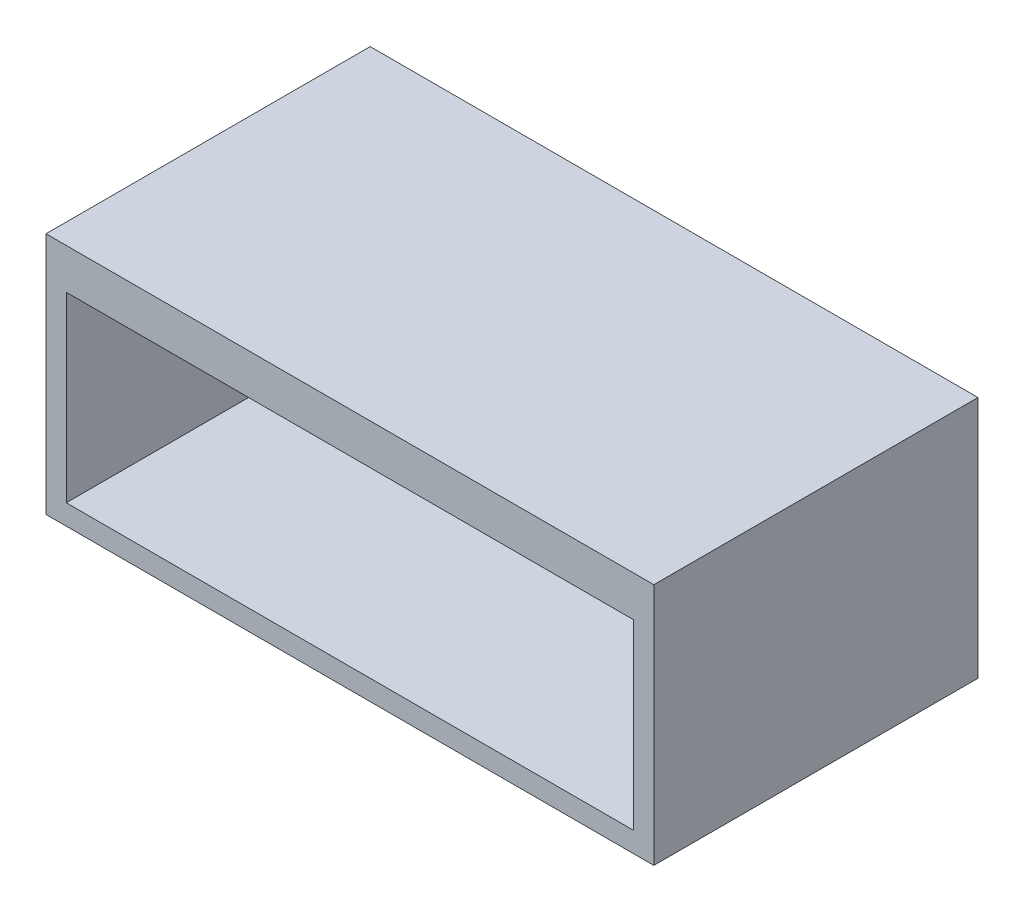
ISO-10303-21;
HEADER;
FILE_DESCRIPTION(('STEP AP214'),'2;1');
FILE_NAME('part.step','',(''),(''),'','','');
FILE_SCHEMA(('AUTOMOTIVE_DESIGN { 1 0 10303 214 1 1 1 1 }'));
ENDSEC;
DATA;
#1=APPLICATION_CONTEXT('core data for automotive mechanical design processes');
#2=APPLICATION_PROTOCOL_DEFINITION('international standard','automotive_design',2000,#1);
#3=PRODUCT_CONTEXT('',#1,'mechanical');
#4=PRODUCT('Part','Part','',(#3));
#5=PRODUCT_RELATED_PRODUCT_CATEGORY('part','',(#4));
#6=PRODUCT_DEFINITION_FORMATION('','',#4);
#7=PRODUCT_DEFINITION_CONTEXT('part definition',#1,'design');
#8=PRODUCT_DEFINITION('design','',#6,#7);
#9=PRODUCT_DEFINITION_SHAPE('','',#8);
#10=(LENGTH_UNIT() NAMED_UNIT(*) SI_UNIT(.MILLI.,.METRE.));
#11=(NAMED_UNIT(*) PLANE_ANGLE_UNIT() SI_UNIT($,.RADIAN.));
#12=(NAMED_UNIT(*) SI_UNIT($,.STERADIAN.) SOLID_ANGLE_UNIT());
#13=UNCERTAINTY_MEASURE_WITH_UNIT(LENGTH_MEASURE(1.E-05),#10,'distance_accuracy_value','');
#14=(GEOMETRIC_REPRESENTATION_CONTEXT(3) GLOBAL_UNCERTAINTY_ASSIGNED_CONTEXT((#13)) GLOBAL_UNIT_ASSIGNED_CONTEXT((#10,
#11,#12)) REPRESENTATION_CONTEXT('',''));
#15=CARTESIAN_POINT('',(0.,0.,0.));
#16=DIRECTION('',(0.,0.,1.));
#17=DIRECTION('',(1.,0.,0.));
#18=AXIS2_PLACEMENT_3D('',#15,#16,#17);
#19=CARTESIAN_POINT('',(0.,60.,0.));
#20=DIRECTION('',(0.,0.,-1.));
#21=DIRECTION('',(-1.,0.,0.));
#22=AXIS2_PLACEMENT_3D('',#19,#20,#21);
#23=PLANE('',#22);
#24=DIRECTION('',(1.,0.,0.));
#25=VECTOR('',#24,1.);
#26=CARTESIAN_POINT('',(0.,0.,0.));
#27=LINE('',#26,#25);
#28=CARTESIAN_POINT('',(0.,0.,0.));
#29=VERTEX_POINT('',#28);
#30=CARTESIAN_POINT('',(150.,0.,0.));
#31=VERTEX_POINT('',#30);
#32=EDGE_CURVE('E156',#29,#31,#27,.T.);
#33=ORIENTED_EDGE('',*,*,#32,.T.);
#34=DIRECTION('',(0.,-1.,0.));
#35=VECTOR('',#34,1.);
#36=CARTESIAN_POINT('',(150.,60.,0.));
#37=LINE('',#36,#35);
#38=CARTESIAN_POINT('',(150.,60.,0.));
#39=VERTEX_POINT('',#38);
#40=EDGE_CURVE('E41',#39,#31,#37,.T.);
#41=ORIENTED_EDGE('',*,*,#40,.F.);
#42=DIRECTION('',(1.,0.,0.));
#43=VECTOR('',#42,1.);
#44=CARTESIAN_POINT('',(0.,60.,0.));
#45=LINE('',#44,#43);
#46=CARTESIAN_POINT('',(0.,60.,0.));
#47=VERTEX_POINT('',#46);
#48=EDGE_CURVE('E85',#47,#39,#45,.T.);
#49=ORIENTED_EDGE('',*,*,#48,.F.);
#50=DIRECTION('',(0.,-1.,0.));
#51=VECTOR('',#50,1.);
#52=CARTESIAN_POINT('',(0.,60.,0.));
#53=LINE('',#52,#51);
#54=EDGE_CURVE('E11',#47,#29,#53,.T.);
#55=ORIENTED_EDGE('',*,*,#54,.T.);
#56=EDGE_LOOP('',(#33,#41,#49,#55));
#57=FACE_BOUND('',#56,.T.);
#58=DIRECTION('',(1.,0.,0.));
#59=VECTOR('',#58,1.);
#60=CARTESIAN_POINT('',(0.,5.,0.));
#61=LINE('',#60,#59);
#62=CARTESIAN_POINT('',(5.,5.,0.));
#63=VERTEX_POINT('',#62);
#64=CARTESIAN_POINT('',(145.,5.,0.));
#65=VERTEX_POINT('',#64);
#66=EDGE_CURVE('E129',#63,#65,#61,.T.);
#67=ORIENTED_EDGE('',*,*,#66,.F.);
#68=DIRECTION('',(0.,-1.,0.));
#69=VECTOR('',#68,1.);
#70=CARTESIAN_POINT('',(5.,60.,0.));
#71=LINE('',#70,#69);
#72=CARTESIAN_POINT('',(5.,50.,0.));
#73=VERTEX_POINT('',#72);
#74=EDGE_CURVE('E128',#73,#63,#71,.T.);
#75=ORIENTED_EDGE('',*,*,#74,.F.);
#76=DIRECTION('',(1.,0.,0.));
#77=VECTOR('',#76,1.);
#78=CARTESIAN_POINT('',(0.,50.,0.));
#79=LINE('',#78,#77);
#80=CARTESIAN_POINT('',(145.,50.,0.));
#81=VERTEX_POINT('',#80);
#82=EDGE_CURVE('E133',#73,#81,#79,.T.);
#83=ORIENTED_EDGE('',*,*,#82,.T.);
#84=DIRECTION('',(0.,-1.,0.));
#85=VECTOR('',#84,1.);
#86=CARTESIAN_POINT('',(145.,60.,0.));
#87=LINE('',#86,#85);
#88=EDGE_CURVE('E138',#81,#65,#87,.T.);
#89=ORIENTED_EDGE('',*,*,#88,.T.);
#90=EDGE_LOOP('',(#67,#75,#83,#89));
#91=FACE_BOUND('',#90,.T.);
#92=ADVANCED_FACE('F33',(#57,#91),#23,.F.);
#93=CARTESIAN_POINT('',(0.,60.,0.));
#94=DIRECTION('',(1.,0.,0.));
#95=DIRECTION('',(0.,0.,-1.));
#96=AXIS2_PLACEMENT_3D('',#93,#94,#95);
#97=PLANE('',#96);
#98=DIRECTION('',(0.,0.,1.));
#99=VECTOR('',#98,1.);
#100=CARTESIAN_POINT('',(0.,0.,0.));
#101=LINE('',#100,#99);
#102=CARTESIAN_POINT('',(0.,0.,-80.));
#103=VERTEX_POINT('',#102);
#104=EDGE_CURVE('E141',#103,#29,#101,.T.);
#105=ORIENTED_EDGE('',*,*,#104,.T.);
#106=ORIENTED_EDGE('',*,*,#54,.F.);
#107=DIRECTION('',(0.,0.,1.));
#108=VECTOR('',#107,1.);
#109=CARTESIAN_POINT('',(0.,60.,0.));
#110=LINE('',#109,#108);
#111=CARTESIAN_POINT('',(0.,60.,-80.));
#112=VERTEX_POINT('',#111);
#113=EDGE_CURVE('E147',#112,#47,#110,.T.);
#114=ORIENTED_EDGE('',*,*,#113,.F.);
#115=DIRECTION('',(0.,-1.,0.));
#116=VECTOR('',#115,1.);
#117=CARTESIAN_POINT('',(0.,60.,-80.));
#118=LINE('',#117,#116);
#119=EDGE_CURVE('E153',#112,#103,#118,.T.);
#120=ORIENTED_EDGE('',*,*,#119,.T.);
#121=EDGE_LOOP('',(#105,#106,#114,#120));
#122=FACE_BOUND('',#121,.T.);
#123=ADVANCED_FACE('F35',(#122),#97,.F.);
#124=CARTESIAN_POINT('',(150.,60.,0.));
#125=DIRECTION('',(-1.,0.,0.));
#126=DIRECTION('',(0.,0.,1.));
#127=AXIS2_PLACEMENT_3D('',#124,#125,#126);
#128=PLANE('',#127);
#129=DIRECTION('',(0.,0.,-1.));
#130=VECTOR('',#129,1.);
#131=CARTESIAN_POINT('',(150.,0.,0.));
#132=LINE('',#131,#130);
#133=CARTESIAN_POINT('',(150.,0.,-80.));
#134=VERTEX_POINT('',#133);
#135=EDGE_CURVE('E158',#31,#134,#132,.T.);
#136=ORIENTED_EDGE('',*,*,#135,.T.);
#137=DIRECTION('',(0.,-1.,0.));
#138=VECTOR('',#137,1.);
#139=CARTESIAN_POINT('',(150.,60.,-80.));
#140=LINE('',#139,#138);
#141=CARTESIAN_POINT('',(150.,60.,-80.));
#142=VERTEX_POINT('',#141);
#143=EDGE_CURVE('E162',#142,#134,#140,.T.);
#144=ORIENTED_EDGE('',*,*,#143,.F.);
#145=DIRECTION('',(0.,0.,-1.));
#146=VECTOR('',#145,1.);
#147=CARTESIAN_POINT('',(150.,60.,0.));
#148=LINE('',#147,#146);
#149=EDGE_CURVE('E150',#39,#142,#148,.T.);
#150=ORIENTED_EDGE('',*,*,#149,.F.);
#151=ORIENTED_EDGE('',*,*,#40,.T.);
#152=EDGE_LOOP('',(#136,#144,#150,#151));
#153=FACE_BOUND('',#152,.T.);
#154=ADVANCED_FACE('F167',(#153),#128,.F.);
#155=CARTESIAN_POINT('',(0.,60.,-80.));
#156=DIRECTION('',(0.,0.,1.));
#157=DIRECTION('',(1.,0.,0.));
#158=AXIS2_PLACEMENT_3D('',#155,#156,#157);
#159=PLANE('',#158);
#160=DIRECTION('',(-1.,0.,0.));
#161=VECTOR('',#160,1.);
#162=CARTESIAN_POINT('',(0.,0.,-80.));
#163=LINE('',#162,#161);
#164=EDGE_CURVE('E78',#134,#103,#163,.T.);
#165=ORIENTED_EDGE('',*,*,#164,.T.);
#166=ORIENTED_EDGE('',*,*,#119,.F.);
#167=DIRECTION('',(-1.,0.,0.));
#168=VECTOR('',#167,1.);
#169=CARTESIAN_POINT('',(0.,60.,-80.));
#170=LINE('',#169,#168);
#171=EDGE_CURVE('E57',#142,#112,#170,.T.);
#172=ORIENTED_EDGE('',*,*,#171,.F.);
#173=ORIENTED_EDGE('',*,*,#143,.T.);
#174=EDGE_LOOP('',(#165,#166,#172,#173));
#175=FACE_BOUND('',#174,.T.);
#176=ADVANCED_FACE('F175',(#175),#159,.F.);
#177=CARTESIAN_POINT('',(0.,60.,0.));
#178=DIRECTION('',(0.,-1.,0.));
#179=DIRECTION('',(0.,0.,-1.));
#180=AXIS2_PLACEMENT_3D('',#177,#178,#179);
#181=PLANE('',#180);
#182=ORIENTED_EDGE('',*,*,#113,.T.);
#183=ORIENTED_EDGE('',*,*,#48,.T.);
#184=ORIENTED_EDGE('',*,*,#149,.T.);
#185=ORIENTED_EDGE('',*,*,#171,.T.);
#186=EDGE_LOOP('',(#182,#183,#184,#185));
#187=FACE_BOUND('',#186,.T.);
#188=ADVANCED_FACE('F177',(#187),#181,.F.);
#189=CARTESIAN_POINT('',(0.,0.,0.));
#190=DIRECTION('',(0.,-1.,0.));
#191=DIRECTION('',(0.,0.,-1.));
#192=AXIS2_PLACEMENT_3D('',#189,#190,#191);
#193=PLANE('',#192);
#194=ORIENTED_EDGE('',*,*,#104,.F.);
#195=ORIENTED_EDGE('',*,*,#164,.F.);
#196=ORIENTED_EDGE('',*,*,#135,.F.);
#197=ORIENTED_EDGE('',*,*,#32,.F.);
#198=EDGE_LOOP('',(#194,#195,#196,#197));
#199=FACE_BOUND('',#198,.T.);
#200=ADVANCED_FACE('F171',(#199),#193,.T.);
#201=CARTESIAN_POINT('',(5.,60.,0.));
#202=DIRECTION('',(1.,0.,0.));
#203=DIRECTION('',(0.,0.,-1.));
#204=AXIS2_PLACEMENT_3D('',#201,#202,#203);
#205=PLANE('',#204);
#206=DIRECTION('',(0.,0.,1.));
#207=VECTOR('',#206,1.);
#208=CARTESIAN_POINT('',(5.,5.,0.));
#209=LINE('',#208,#207);
#210=CARTESIAN_POINT('',(5.,5.,-75.));
#211=VERTEX_POINT('',#210);
#212=EDGE_CURVE('E112',#211,#63,#209,.T.);
#213=ORIENTED_EDGE('',*,*,#212,.F.);
#214=DIRECTION('',(0.,-1.,0.));
#215=VECTOR('',#214,1.);
#216=CARTESIAN_POINT('',(5.,60.,-75.));
#217=LINE('',#216,#215);
#218=CARTESIAN_POINT('',(5.,50.,-75.));
#219=VERTEX_POINT('',#218);
#220=EDGE_CURVE('E120',#219,#211,#217,.T.);
#221=ORIENTED_EDGE('',*,*,#220,.F.);
#222=DIRECTION('',(0.,0.,1.));
#223=VECTOR('',#222,1.);
#224=CARTESIAN_POINT('',(5.,50.,0.));
#225=LINE('',#224,#223);
#226=EDGE_CURVE('E48',#219,#73,#225,.T.);
#227=ORIENTED_EDGE('',*,*,#226,.T.);
#228=ORIENTED_EDGE('',*,*,#74,.T.);
#229=EDGE_LOOP('',(#213,#221,#227,#228));
#230=FACE_BOUND('',#229,.T.);
#231=ADVANCED_FACE('F126',(#230),#205,.T.);
#232=CARTESIAN_POINT('',(145.,60.,0.));
#233=DIRECTION('',(-1.,0.,0.));
#234=DIRECTION('',(0.,0.,1.));
#235=AXIS2_PLACEMENT_3D('',#232,#233,#234);
#236=PLANE('',#235);
#237=DIRECTION('',(0.,0.,-1.));
#238=VECTOR('',#237,1.);
#239=CARTESIAN_POINT('',(145.,5.,0.));
#240=LINE('',#239,#238);
#241=CARTESIAN_POINT('',(145.,5.,-75.));
#242=VERTEX_POINT('',#241);
#243=EDGE_CURVE('E115',#65,#242,#240,.T.);
#244=ORIENTED_EDGE('',*,*,#243,.F.);
#245=ORIENTED_EDGE('',*,*,#88,.F.);
#246=DIRECTION('',(0.,0.,-1.));
#247=VECTOR('',#246,1.);
#248=CARTESIAN_POINT('',(145.,50.,0.));
#249=LINE('',#248,#247);
#250=CARTESIAN_POINT('',(145.,50.,-75.));
#251=VERTEX_POINT('',#250);
#252=EDGE_CURVE('E136',#81,#251,#249,.T.);
#253=ORIENTED_EDGE('',*,*,#252,.T.);
#254=DIRECTION('',(0.,-1.,0.));
#255=VECTOR('',#254,1.);
#256=CARTESIAN_POINT('',(145.,60.,-75.));
#257=LINE('',#256,#255);
#258=EDGE_CURVE('E124',#251,#242,#257,.T.);
#259=ORIENTED_EDGE('',*,*,#258,.T.);
#260=EDGE_LOOP('',(#244,#245,#253,#259));
#261=FACE_BOUND('',#260,.T.);
#262=ADVANCED_FACE('F192',(#261),#236,.T.);
#263=CARTESIAN_POINT('',(0.,60.,-75.));
#264=DIRECTION('',(0.,0.,1.));
#265=DIRECTION('',(1.,0.,0.));
#266=AXIS2_PLACEMENT_3D('',#263,#264,#265);
#267=PLANE('',#266);
#268=DIRECTION('',(-1.,0.,0.));
#269=VECTOR('',#268,1.);
#270=CARTESIAN_POINT('',(0.,5.,-75.));
#271=LINE('',#270,#269);
#272=EDGE_CURVE('E108',#242,#211,#271,.T.);
#273=ORIENTED_EDGE('',*,*,#272,.F.);
#274=ORIENTED_EDGE('',*,*,#258,.F.);
#275=DIRECTION('',(-1.,0.,0.));
#276=VECTOR('',#275,1.);
#277=CARTESIAN_POINT('',(0.,50.,-75.));
#278=LINE('',#277,#276);
#279=EDGE_CURVE('E123',#251,#219,#278,.T.);
#280=ORIENTED_EDGE('',*,*,#279,.T.);
#281=ORIENTED_EDGE('',*,*,#220,.T.);
#282=EDGE_LOOP('',(#273,#274,#280,#281));
#283=FACE_BOUND('',#282,.T.);
#284=ADVANCED_FACE('F121',(#283),#267,.T.);
#285=CARTESIAN_POINT('',(0.,50.,0.));
#286=DIRECTION('',(0.,-1.,0.));
#287=DIRECTION('',(0.,0.,-1.));
#288=AXIS2_PLACEMENT_3D('',#285,#286,#287);
#289=PLANE('',#288);
#290=ORIENTED_EDGE('',*,*,#226,.F.);
#291=ORIENTED_EDGE('',*,*,#279,.F.);
#292=ORIENTED_EDGE('',*,*,#252,.F.);
#293=ORIENTED_EDGE('',*,*,#82,.F.);
#294=EDGE_LOOP('',(#290,#291,#292,#293));
#295=FACE_BOUND('',#294,.T.);
#296=ADVANCED_FACE('F195',(#295),#289,.T.);
#297=CARTESIAN_POINT('',(0.,5.,0.));
#298=DIRECTION('',(0.,-1.,0.));
#299=DIRECTION('',(0.,0.,-1.));
#300=AXIS2_PLACEMENT_3D('',#297,#298,#299);
#301=PLANE('',#300);
#302=ORIENTED_EDGE('',*,*,#212,.T.);
#303=ORIENTED_EDGE('',*,*,#66,.T.);
#304=ORIENTED_EDGE('',*,*,#243,.T.);
#305=ORIENTED_EDGE('',*,*,#272,.T.);
#306=EDGE_LOOP('',(#302,#303,#304,#305));
#307=FACE_BOUND('',#306,.T.);
#308=ADVANCED_FACE('F110',(#307),#301,.F.);
#309=CLOSED_SHELL('',(#92,#123,#154,#176,#188,#200,#231,#262,#284,#296,#308));
#310=MANIFOLD_SOLID_BREP('B2',#309);
#311=ADVANCED_BREP_SHAPE_REPRESENTATION('',(#18,#310),#14);
#312=SHAPE_DEFINITION_REPRESENTATION(#9,#311);
ENDSEC;
END-ISO-10303-21;
